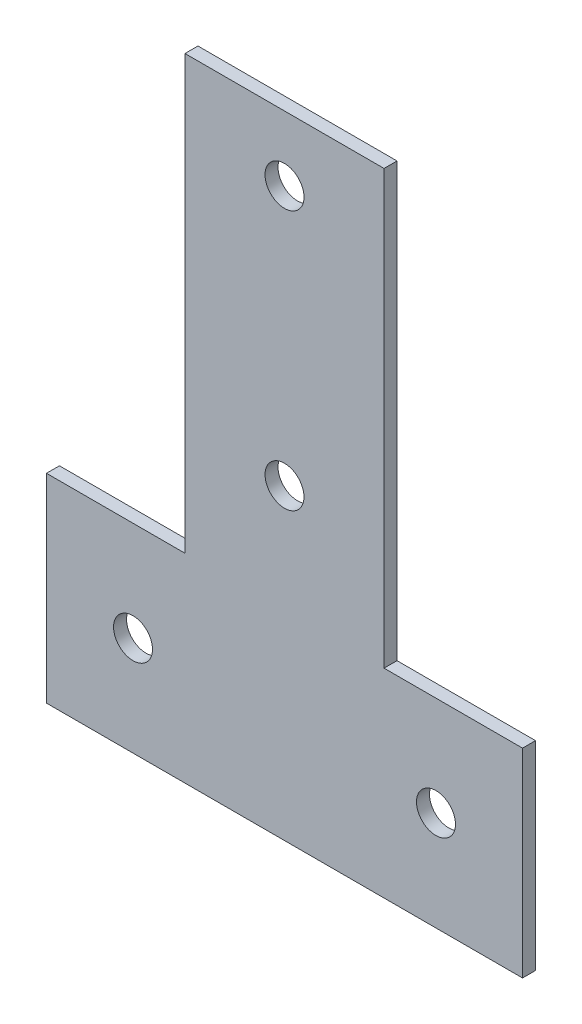
ISO-10303-21;
HEADER;
FILE_DESCRIPTION(('STEP AP214'),'2;1');
FILE_NAME('part.step','',(''),(''),'','','');
FILE_SCHEMA(('AUTOMOTIVE_DESIGN { 1 0 10303 214 1 1 1 1 }'));
ENDSEC;
DATA;
#1=APPLICATION_CONTEXT('core data for automotive mechanical design processes');
#2=APPLICATION_PROTOCOL_DEFINITION('international standard','automotive_design',2000,#1);
#3=PRODUCT_CONTEXT('',#1,'mechanical');
#4=PRODUCT('Part','Part','',(#3));
#5=PRODUCT_RELATED_PRODUCT_CATEGORY('part','',(#4));
#6=PRODUCT_DEFINITION_FORMATION('','',#4);
#7=PRODUCT_DEFINITION_CONTEXT('part definition',#1,'design');
#8=PRODUCT_DEFINITION('design','',#6,#7);
#9=PRODUCT_DEFINITION_SHAPE('','',#8);
#10=(LENGTH_UNIT() NAMED_UNIT(*) SI_UNIT(.MILLI.,.METRE.));
#11=(NAMED_UNIT(*) PLANE_ANGLE_UNIT() SI_UNIT($,.RADIAN.));
#12=(NAMED_UNIT(*) SI_UNIT($,.STERADIAN.) SOLID_ANGLE_UNIT());
#13=UNCERTAINTY_MEASURE_WITH_UNIT(LENGTH_MEASURE(1.E-05),#10,'distance_accuracy_value','');
#14=(GEOMETRIC_REPRESENTATION_CONTEXT(3) GLOBAL_UNCERTAINTY_ASSIGNED_CONTEXT((#13)) GLOBAL_UNIT_ASSIGNED_CONTEXT((#10,
#11,#12)) REPRESENTATION_CONTEXT('',''));
#15=CARTESIAN_POINT('',(0.,0.,0.));
#16=DIRECTION('',(0.,0.,1.));
#17=DIRECTION('',(1.,0.,0.));
#18=AXIS2_PLACEMENT_3D('',#15,#16,#17);
#19=CARTESIAN_POINT('',(0.,0.,3.));
#20=DIRECTION('',(0.,0.,1.));
#21=DIRECTION('',(1.,0.,0.));
#22=AXIS2_PLACEMENT_3D('',#19,#20,#21);
#23=PLANE('',#22);
#24=CARTESIAN_POINT('',(-35.,23.,3.));
#25=DIRECTION('',(0.,0.,1.));
#26=DIRECTION('',(1.,0.,0.));
#27=AXIS2_PLACEMENT_3D('',#24,#25,#26);
#28=CIRCLE('',#27,4.5);
#29=CARTESIAN_POINT('',(-30.5,23.,3.));
#30=VERTEX_POINT('',#29);
#31=EDGE_CURVE('E189',#30,#30,#28,.T.);
#32=ORIENTED_EDGE('',*,*,#31,.F.);
#33=EDGE_LOOP('',(#32));
#34=FACE_BOUND('',#33,.T.);
#35=CARTESIAN_POINT('',(0.,131.,3.));
#36=DIRECTION('',(0.,0.,1.));
#37=DIRECTION('',(1.,0.,0.));
#38=AXIS2_PLACEMENT_3D('',#35,#36,#37);
#39=CIRCLE('',#38,4.5);
#40=CARTESIAN_POINT('',(4.5,131.,3.));
#41=VERTEX_POINT('',#40);
#42=EDGE_CURVE('E135',#41,#41,#39,.T.);
#43=ORIENTED_EDGE('',*,*,#42,.F.);
#44=EDGE_LOOP('',(#43));
#45=FACE_BOUND('',#44,.T.);
#46=DIRECTION('',(0.,1.,0.));
#47=VECTOR('',#46,1.);
#48=CARTESIAN_POINT('',(55.,46.,3.));
#49=LINE('',#48,#47);
#50=CARTESIAN_POINT('',(55.,0.,3.));
#51=VERTEX_POINT('',#50);
#52=CARTESIAN_POINT('',(55.,46.,3.));
#53=VERTEX_POINT('',#52);
#54=EDGE_CURVE('E146',#51,#53,#49,.T.);
#55=ORIENTED_EDGE('',*,*,#54,.T.);
#56=DIRECTION('',(-1.,0.,0.));
#57=VECTOR('',#56,1.);
#58=CARTESIAN_POINT('',(23.,46.,3.));
#59=LINE('',#58,#57);
#60=CARTESIAN_POINT('',(23.,46.,3.));
#61=VERTEX_POINT('',#60);
#62=EDGE_CURVE('E94',#53,#61,#59,.T.);
#63=ORIENTED_EDGE('',*,*,#62,.T.);
#64=DIRECTION('',(0.,1.,0.));
#65=VECTOR('',#64,1.);
#66=CARTESIAN_POINT('',(23.,146.,3.));
#67=LINE('',#66,#65);
#68=CARTESIAN_POINT('',(23.,146.,3.));
#69=VERTEX_POINT('',#68);
#70=EDGE_CURVE('E161',#61,#69,#67,.T.);
#71=ORIENTED_EDGE('',*,*,#70,.T.);
#72=DIRECTION('',(-1.,0.,0.));
#73=VECTOR('',#72,1.);
#74=CARTESIAN_POINT('',(-23.,146.,3.));
#75=LINE('',#74,#73);
#76=CARTESIAN_POINT('',(-23.,146.,3.));
#77=VERTEX_POINT('',#76);
#78=EDGE_CURVE('E174',#69,#77,#75,.T.);
#79=ORIENTED_EDGE('',*,*,#78,.T.);
#80=DIRECTION('',(0.,-1.,0.));
#81=VECTOR('',#80,1.);
#82=CARTESIAN_POINT('',(-23.,46.,3.));
#83=LINE('',#82,#81);
#84=CARTESIAN_POINT('',(-23.,46.,3.));
#85=VERTEX_POINT('',#84);
#86=EDGE_CURVE('E113',#77,#85,#83,.T.);
#87=ORIENTED_EDGE('',*,*,#86,.T.);
#88=DIRECTION('',(-1.,0.,0.));
#89=VECTOR('',#88,1.);
#90=CARTESIAN_POINT('',(-55.,46.,3.));
#91=LINE('',#90,#89);
#92=CARTESIAN_POINT('',(-55.,46.,3.));
#93=VERTEX_POINT('',#92);
#94=EDGE_CURVE('E107',#85,#93,#91,.T.);
#95=ORIENTED_EDGE('',*,*,#94,.T.);
#96=DIRECTION('',(0.,-1.,0.));
#97=VECTOR('',#96,1.);
#98=CARTESIAN_POINT('',(-55.,0.,3.));
#99=LINE('',#98,#97);
#100=CARTESIAN_POINT('',(-55.,0.,3.));
#101=VERTEX_POINT('',#100);
#102=EDGE_CURVE('E111',#93,#101,#99,.T.);
#103=ORIENTED_EDGE('',*,*,#102,.T.);
#104=DIRECTION('',(1.,0.,0.));
#105=VECTOR('',#104,1.);
#106=CARTESIAN_POINT('',(-55.,0.,3.));
#107=LINE('',#106,#105);
#108=EDGE_CURVE('E51',#101,#51,#107,.T.);
#109=ORIENTED_EDGE('',*,*,#108,.T.);
#110=EDGE_LOOP('',(#55,#63,#71,#79,#87,#95,#103,#109));
#111=FACE_BOUND('',#110,.T.);
#112=CARTESIAN_POINT('',(0.,71.,3.));
#113=DIRECTION('',(0.,0.,1.));
#114=DIRECTION('',(1.,0.,0.));
#115=AXIS2_PLACEMENT_3D('',#112,#113,#114);
#116=CIRCLE('',#115,4.5);
#117=CARTESIAN_POINT('',(4.5,71.,3.));
#118=VERTEX_POINT('',#117);
#119=EDGE_CURVE('E183',#118,#118,#116,.T.);
#120=ORIENTED_EDGE('',*,*,#119,.F.);
#121=EDGE_LOOP('',(#120));
#122=FACE_BOUND('',#121,.T.);
#123=CARTESIAN_POINT('',(35.,23.,3.));
#124=DIRECTION('',(0.,0.,1.));
#125=DIRECTION('',(1.,0.,0.));
#126=AXIS2_PLACEMENT_3D('',#123,#124,#125);
#127=CIRCLE('',#126,4.5);
#128=CARTESIAN_POINT('',(39.5,23.,3.));
#129=VERTEX_POINT('',#128);
#130=EDGE_CURVE('E195',#129,#129,#127,.T.);
#131=ORIENTED_EDGE('',*,*,#130,.F.);
#132=EDGE_LOOP('',(#131));
#133=FACE_BOUND('',#132,.T.);
#134=ADVANCED_FACE('F34',(#34,#45,#111,#122,#133),#23,.T.);
#135=CARTESIAN_POINT('',(0.,0.,0.));
#136=DIRECTION('',(0.,0.,1.));
#137=DIRECTION('',(1.,0.,0.));
#138=AXIS2_PLACEMENT_3D('',#135,#136,#137);
#139=PLANE('',#138);
#140=DIRECTION('',(0.,1.,0.));
#141=VECTOR('',#140,1.);
#142=CARTESIAN_POINT('',(55.,46.,0.));
#143=LINE('',#142,#141);
#144=CARTESIAN_POINT('',(55.,0.,0.));
#145=VERTEX_POINT('',#144);
#146=CARTESIAN_POINT('',(55.,46.,0.));
#147=VERTEX_POINT('',#146);
#148=EDGE_CURVE('E131',#145,#147,#143,.T.);
#149=ORIENTED_EDGE('',*,*,#148,.F.);
#150=DIRECTION('',(1.,0.,0.));
#151=VECTOR('',#150,1.);
#152=CARTESIAN_POINT('',(-55.,0.,0.));
#153=LINE('',#152,#151);
#154=CARTESIAN_POINT('',(-55.,0.,0.));
#155=VERTEX_POINT('',#154);
#156=EDGE_CURVE('E86',#155,#145,#153,.T.);
#157=ORIENTED_EDGE('',*,*,#156,.F.);
#158=DIRECTION('',(0.,-1.,0.));
#159=VECTOR('',#158,1.);
#160=CARTESIAN_POINT('',(-55.,0.,0.));
#161=LINE('',#160,#159);
#162=CARTESIAN_POINT('',(-55.,46.,0.));
#163=VERTEX_POINT('',#162);
#164=EDGE_CURVE('E80',#163,#155,#161,.T.);
#165=ORIENTED_EDGE('',*,*,#164,.F.);
#166=DIRECTION('',(-1.,0.,0.));
#167=VECTOR('',#166,1.);
#168=CARTESIAN_POINT('',(-55.,46.,0.));
#169=LINE('',#168,#167);
#170=CARTESIAN_POINT('',(-23.,46.,0.));
#171=VERTEX_POINT('',#170);
#172=EDGE_CURVE('E121',#171,#163,#169,.T.);
#173=ORIENTED_EDGE('',*,*,#172,.F.);
#174=DIRECTION('',(0.,-1.,0.));
#175=VECTOR('',#174,1.);
#176=CARTESIAN_POINT('',(-23.,46.,0.));
#177=LINE('',#176,#175);
#178=CARTESIAN_POINT('',(-23.,146.,0.));
#179=VERTEX_POINT('',#178);
#180=EDGE_CURVE('E141',#179,#171,#177,.T.);
#181=ORIENTED_EDGE('',*,*,#180,.F.);
#182=DIRECTION('',(-1.,0.,0.));
#183=VECTOR('',#182,1.);
#184=CARTESIAN_POINT('',(-23.,146.,0.));
#185=LINE('',#184,#183);
#186=CARTESIAN_POINT('',(23.,146.,0.));
#187=VERTEX_POINT('',#186);
#188=EDGE_CURVE('E139',#187,#179,#185,.T.);
#189=ORIENTED_EDGE('',*,*,#188,.F.);
#190=DIRECTION('',(0.,1.,0.));
#191=VECTOR('',#190,1.);
#192=CARTESIAN_POINT('',(23.,146.,0.));
#193=LINE('',#192,#191);
#194=CARTESIAN_POINT('',(23.,46.,0.));
#195=VERTEX_POINT('',#194);
#196=EDGE_CURVE('E137',#195,#187,#193,.T.);
#197=ORIENTED_EDGE('',*,*,#196,.F.);
#198=DIRECTION('',(-1.,0.,0.));
#199=VECTOR('',#198,1.);
#200=CARTESIAN_POINT('',(23.,46.,0.));
#201=LINE('',#200,#199);
#202=EDGE_CURVE('E134',#147,#195,#201,.T.);
#203=ORIENTED_EDGE('',*,*,#202,.F.);
#204=EDGE_LOOP('',(#149,#157,#165,#173,#181,#189,#197,#203));
#205=FACE_BOUND('',#204,.T.);
#206=CARTESIAN_POINT('',(0.,131.,0.));
#207=DIRECTION('',(0.,0.,1.));
#208=DIRECTION('',(1.,0.,0.));
#209=AXIS2_PLACEMENT_3D('',#206,#207,#208);
#210=CIRCLE('',#209,4.5);
#211=CARTESIAN_POINT('',(4.5,131.,0.));
#212=VERTEX_POINT('',#211);
#213=EDGE_CURVE('E180',#212,#212,#210,.T.);
#214=ORIENTED_EDGE('',*,*,#213,.T.);
#215=EDGE_LOOP('',(#214));
#216=FACE_BOUND('',#215,.T.);
#217=CARTESIAN_POINT('',(0.,71.,0.));
#218=DIRECTION('',(0.,0.,1.));
#219=DIRECTION('',(1.,0.,0.));
#220=AXIS2_PLACEMENT_3D('',#217,#218,#219);
#221=CIRCLE('',#220,4.5);
#222=CARTESIAN_POINT('',(4.5,71.,0.));
#223=VERTEX_POINT('',#222);
#224=EDGE_CURVE('E186',#223,#223,#221,.T.);
#225=ORIENTED_EDGE('',*,*,#224,.T.);
#226=EDGE_LOOP('',(#225));
#227=FACE_BOUND('',#226,.T.);
#228=CARTESIAN_POINT('',(-35.,23.,0.));
#229=DIRECTION('',(0.,0.,1.));
#230=DIRECTION('',(1.,0.,0.));
#231=AXIS2_PLACEMENT_3D('',#228,#229,#230);
#232=CIRCLE('',#231,4.5);
#233=CARTESIAN_POINT('',(-30.5,23.,0.));
#234=VERTEX_POINT('',#233);
#235=EDGE_CURVE('E192',#234,#234,#232,.T.);
#236=ORIENTED_EDGE('',*,*,#235,.T.);
#237=EDGE_LOOP('',(#236));
#238=FACE_BOUND('',#237,.T.);
#239=CARTESIAN_POINT('',(35.,23.,0.));
#240=DIRECTION('',(0.,0.,1.));
#241=DIRECTION('',(1.,0.,0.));
#242=AXIS2_PLACEMENT_3D('',#239,#240,#241);
#243=CIRCLE('',#242,4.5);
#244=CARTESIAN_POINT('',(39.5,23.,0.));
#245=VERTEX_POINT('',#244);
#246=EDGE_CURVE('E198',#245,#245,#243,.T.);
#247=ORIENTED_EDGE('',*,*,#246,.T.);
#248=EDGE_LOOP('',(#247));
#249=FACE_BOUND('',#248,.T.);
#250=ADVANCED_FACE('F165',(#205,#216,#227,#238,#249),#139,.F.);
#251=CARTESIAN_POINT('',(55.,46.,3.));
#252=DIRECTION('',(-1.,0.,0.));
#253=DIRECTION('',(0.,0.,1.));
#254=AXIS2_PLACEMENT_3D('',#251,#252,#253);
#255=PLANE('',#254);
#256=ORIENTED_EDGE('',*,*,#148,.T.);
#257=DIRECTION('',(0.,0.,-1.));
#258=VECTOR('',#257,1.);
#259=CARTESIAN_POINT('',(55.,46.,3.));
#260=LINE('',#259,#258);
#261=EDGE_CURVE('E11',#53,#147,#260,.T.);
#262=ORIENTED_EDGE('',*,*,#261,.F.);
#263=ORIENTED_EDGE('',*,*,#54,.F.);
#264=DIRECTION('',(0.,0.,-1.));
#265=VECTOR('',#264,1.);
#266=CARTESIAN_POINT('',(55.,0.,3.));
#267=LINE('',#266,#265);
#268=EDGE_CURVE('E127',#51,#145,#267,.T.);
#269=ORIENTED_EDGE('',*,*,#268,.T.);
#270=EDGE_LOOP('',(#256,#262,#263,#269));
#271=FACE_BOUND('',#270,.T.);
#272=ADVANCED_FACE('F36',(#271),#255,.F.);
#273=CARTESIAN_POINT('',(23.,46.,3.));
#274=DIRECTION('',(0.,-1.,0.));
#275=DIRECTION('',(0.,0.,-1.));
#276=AXIS2_PLACEMENT_3D('',#273,#274,#275);
#277=PLANE('',#276);
#278=ORIENTED_EDGE('',*,*,#202,.T.);
#279=DIRECTION('',(0.,0.,-1.));
#280=VECTOR('',#279,1.);
#281=CARTESIAN_POINT('',(23.,46.,3.));
#282=LINE('',#281,#280);
#283=EDGE_CURVE('E43',#61,#195,#282,.T.);
#284=ORIENTED_EDGE('',*,*,#283,.F.);
#285=ORIENTED_EDGE('',*,*,#62,.F.);
#286=ORIENTED_EDGE('',*,*,#261,.T.);
#287=EDGE_LOOP('',(#278,#284,#285,#286));
#288=FACE_BOUND('',#287,.T.);
#289=ADVANCED_FACE('F232',(#288),#277,.F.);
#290=CARTESIAN_POINT('',(23.,146.,3.));
#291=DIRECTION('',(-1.,0.,0.));
#292=DIRECTION('',(0.,0.,1.));
#293=AXIS2_PLACEMENT_3D('',#290,#291,#292);
#294=PLANE('',#293);
#295=ORIENTED_EDGE('',*,*,#196,.T.);
#296=DIRECTION('',(0.,0.,-1.));
#297=VECTOR('',#296,1.);
#298=CARTESIAN_POINT('',(23.,146.,3.));
#299=LINE('',#298,#297);
#300=EDGE_CURVE('E153',#69,#187,#299,.T.);
#301=ORIENTED_EDGE('',*,*,#300,.F.);
#302=ORIENTED_EDGE('',*,*,#70,.F.);
#303=ORIENTED_EDGE('',*,*,#283,.T.);
#304=EDGE_LOOP('',(#295,#301,#302,#303));
#305=FACE_BOUND('',#304,.T.);
#306=ADVANCED_FACE('F159',(#305),#294,.F.);
#307=CARTESIAN_POINT('',(-23.,146.,3.));
#308=DIRECTION('',(0.,-1.,0.));
#309=DIRECTION('',(0.,0.,-1.));
#310=AXIS2_PLACEMENT_3D('',#307,#308,#309);
#311=PLANE('',#310);
#312=ORIENTED_EDGE('',*,*,#188,.T.);
#313=DIRECTION('',(0.,0.,-1.));
#314=VECTOR('',#313,1.);
#315=CARTESIAN_POINT('',(-23.,146.,3.));
#316=LINE('',#315,#314);
#317=EDGE_CURVE('E150',#77,#179,#316,.T.);
#318=ORIENTED_EDGE('',*,*,#317,.F.);
#319=ORIENTED_EDGE('',*,*,#78,.F.);
#320=ORIENTED_EDGE('',*,*,#300,.T.);
#321=EDGE_LOOP('',(#312,#318,#319,#320));
#322=FACE_BOUND('',#321,.T.);
#323=ADVANCED_FACE('F170',(#322),#311,.F.);
#324=CARTESIAN_POINT('',(-23.,46.,3.));
#325=DIRECTION('',(1.,0.,0.));
#326=DIRECTION('',(0.,0.,-1.));
#327=AXIS2_PLACEMENT_3D('',#324,#325,#326);
#328=PLANE('',#327);
#329=ORIENTED_EDGE('',*,*,#180,.T.);
#330=DIRECTION('',(0.,0.,-1.));
#331=VECTOR('',#330,1.);
#332=CARTESIAN_POINT('',(-23.,46.,3.));
#333=LINE('',#332,#331);
#334=EDGE_CURVE('E122',#85,#171,#333,.T.);
#335=ORIENTED_EDGE('',*,*,#334,.F.);
#336=ORIENTED_EDGE('',*,*,#86,.F.);
#337=ORIENTED_EDGE('',*,*,#317,.T.);
#338=EDGE_LOOP('',(#329,#335,#336,#337));
#339=FACE_BOUND('',#338,.T.);
#340=ADVANCED_FACE('F173',(#339),#328,.F.);
#341=CARTESIAN_POINT('',(-55.,46.,3.));
#342=DIRECTION('',(0.,-1.,0.));
#343=DIRECTION('',(0.,0.,-1.));
#344=AXIS2_PLACEMENT_3D('',#341,#342,#343);
#345=PLANE('',#344);
#346=ORIENTED_EDGE('',*,*,#172,.T.);
#347=DIRECTION('',(0.,0.,-1.));
#348=VECTOR('',#347,1.);
#349=CARTESIAN_POINT('',(-55.,46.,3.));
#350=LINE('',#349,#348);
#351=EDGE_CURVE('E118',#93,#163,#350,.T.);
#352=ORIENTED_EDGE('',*,*,#351,.F.);
#353=ORIENTED_EDGE('',*,*,#94,.F.);
#354=ORIENTED_EDGE('',*,*,#334,.T.);
#355=EDGE_LOOP('',(#346,#352,#353,#354));
#356=FACE_BOUND('',#355,.T.);
#357=ADVANCED_FACE('F119',(#356),#345,.F.);
#358=CARTESIAN_POINT('',(-55.,0.,3.));
#359=DIRECTION('',(1.,0.,0.));
#360=DIRECTION('',(0.,0.,-1.));
#361=AXIS2_PLACEMENT_3D('',#358,#359,#360);
#362=PLANE('',#361);
#363=ORIENTED_EDGE('',*,*,#164,.T.);
#364=DIRECTION('',(0.,0.,-1.));
#365=VECTOR('',#364,1.);
#366=CARTESIAN_POINT('',(-55.,0.,3.));
#367=LINE('',#366,#365);
#368=EDGE_CURVE('E123',#101,#155,#367,.T.);
#369=ORIENTED_EDGE('',*,*,#368,.F.);
#370=ORIENTED_EDGE('',*,*,#102,.F.);
#371=ORIENTED_EDGE('',*,*,#351,.T.);
#372=EDGE_LOOP('',(#363,#369,#370,#371));
#373=FACE_BOUND('',#372,.T.);
#374=ADVANCED_FACE('F125',(#373),#362,.F.);
#375=CARTESIAN_POINT('',(-55.,0.,3.));
#376=DIRECTION('',(0.,1.,0.));
#377=DIRECTION('',(-1.,0.,0.));
#378=AXIS2_PLACEMENT_3D('',#375,#376,#377);
#379=PLANE('',#378);
#380=ORIENTED_EDGE('',*,*,#156,.T.);
#381=ORIENTED_EDGE('',*,*,#268,.F.);
#382=ORIENTED_EDGE('',*,*,#108,.F.);
#383=ORIENTED_EDGE('',*,*,#368,.T.);
#384=EDGE_LOOP('',(#380,#381,#382,#383));
#385=FACE_BOUND('',#384,.T.);
#386=ADVANCED_FACE('F220',(#385),#379,.F.);
#387=CARTESIAN_POINT('',(0.,131.,3.));
#388=DIRECTION('',(0.,0.,-1.));
#389=DIRECTION('',(-1.,0.,0.));
#390=AXIS2_PLACEMENT_3D('',#387,#388,#389);
#391=CYLINDRICAL_SURFACE('',#390,4.5);
#392=ORIENTED_EDGE('',*,*,#42,.T.);
#393=EDGE_LOOP('',(#392));
#394=FACE_BOUND('',#393,.T.);
#395=ORIENTED_EDGE('',*,*,#213,.F.);
#396=EDGE_LOOP('',(#395));
#397=FACE_BOUND('',#396,.T.);
#398=ADVANCED_FACE('F217',(#394,#397),#391,.F.);
#399=CARTESIAN_POINT('',(0.,71.,3.));
#400=DIRECTION('',(0.,0.,-1.));
#401=DIRECTION('',(-1.,0.,0.));
#402=AXIS2_PLACEMENT_3D('',#399,#400,#401);
#403=CYLINDRICAL_SURFACE('',#402,4.5);
#404=ORIENTED_EDGE('',*,*,#119,.T.);
#405=EDGE_LOOP('',(#404));
#406=FACE_BOUND('',#405,.T.);
#407=ORIENTED_EDGE('',*,*,#224,.F.);
#408=EDGE_LOOP('',(#407));
#409=FACE_BOUND('',#408,.T.);
#410=ADVANCED_FACE('F296',(#406,#409),#403,.F.);
#411=CARTESIAN_POINT('',(-35.,23.,3.));
#412=DIRECTION('',(0.,0.,-1.));
#413=DIRECTION('',(-1.,0.,0.));
#414=AXIS2_PLACEMENT_3D('',#411,#412,#413);
#415=CYLINDRICAL_SURFACE('',#414,4.5);
#416=ORIENTED_EDGE('',*,*,#31,.T.);
#417=EDGE_LOOP('',(#416));
#418=FACE_BOUND('',#417,.T.);
#419=ORIENTED_EDGE('',*,*,#235,.F.);
#420=EDGE_LOOP('',(#419));
#421=FACE_BOUND('',#420,.T.);
#422=ADVANCED_FACE('F304',(#418,#421),#415,.F.);
#423=CARTESIAN_POINT('',(35.,23.,3.));
#424=DIRECTION('',(0.,0.,-1.));
#425=DIRECTION('',(-1.,0.,0.));
#426=AXIS2_PLACEMENT_3D('',#423,#424,#425);
#427=CYLINDRICAL_SURFACE('',#426,4.5);
#428=ORIENTED_EDGE('',*,*,#130,.T.);
#429=EDGE_LOOP('',(#428));
#430=FACE_BOUND('',#429,.T.);
#431=ORIENTED_EDGE('',*,*,#246,.F.);
#432=EDGE_LOOP('',(#431));
#433=FACE_BOUND('',#432,.T.);
#434=ADVANCED_FACE('F204',(#430,#433),#427,.F.);
#435=CLOSED_SHELL('',(#134,#250,#272,#289,#306,#323,#340,#357,#374,#386,#398,#410,#422,#434));
#436=MANIFOLD_SOLID_BREP('B2',#435);
#437=ADVANCED_BREP_SHAPE_REPRESENTATION('',(#18,#436),#14);
#438=SHAPE_DEFINITION_REPRESENTATION(#9,#437);
ENDSEC;
END-ISO-10303-21;
